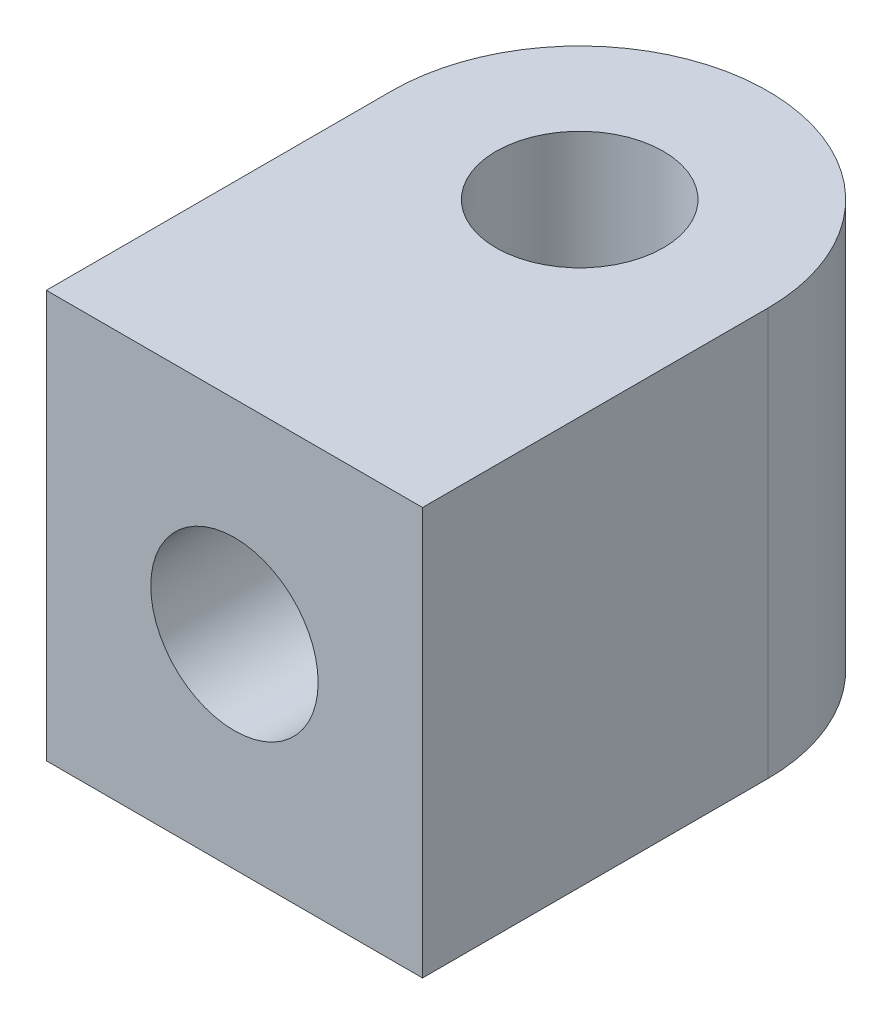
ISO-10303-21;
HEADER;
FILE_DESCRIPTION(('STEP AP214'),'2;1');
FILE_NAME('part.step','',(''),(''),'','','');
FILE_SCHEMA(('AUTOMOTIVE_DESIGN { 1 0 10303 214 1 1 1 1 }'));
ENDSEC;
DATA;
#1=APPLICATION_CONTEXT('core data for automotive mechanical design processes');
#2=APPLICATION_PROTOCOL_DEFINITION('international standard','automotive_design',2000,#1);
#3=PRODUCT_CONTEXT('',#1,'mechanical');
#4=PRODUCT('Part','Part','',(#3));
#5=PRODUCT_RELATED_PRODUCT_CATEGORY('part','',(#4));
#6=PRODUCT_DEFINITION_FORMATION('','',#4);
#7=PRODUCT_DEFINITION_CONTEXT('part definition',#1,'design');
#8=PRODUCT_DEFINITION('design','',#6,#7);
#9=PRODUCT_DEFINITION_SHAPE('','',#8);
#10=(LENGTH_UNIT() NAMED_UNIT(*) SI_UNIT(.MILLI.,.METRE.));
#11=(NAMED_UNIT(*) PLANE_ANGLE_UNIT() SI_UNIT($,.RADIAN.));
#12=(NAMED_UNIT(*) SI_UNIT($,.STERADIAN.) SOLID_ANGLE_UNIT());
#13=UNCERTAINTY_MEASURE_WITH_UNIT(LENGTH_MEASURE(1.E-05),#10,'distance_accuracy_value','');
#14=(GEOMETRIC_REPRESENTATION_CONTEXT(3) GLOBAL_UNCERTAINTY_ASSIGNED_CONTEXT((#13)) GLOBAL_UNIT_ASSIGNED_CONTEXT((#10,
#11,#12)) REPRESENTATION_CONTEXT('',''));
#15=CARTESIAN_POINT('',(0.,0.,0.));
#16=DIRECTION('',(0.,0.,1.));
#17=DIRECTION('',(1.,0.,0.));
#18=AXIS2_PLACEMENT_3D('',#15,#16,#17);
#19=CARTESIAN_POINT('',(0.,6.58622,0.));
#20=DIRECTION('',(0.,-1.,0.));
#21=DIRECTION('',(0.,0.,-1.));
#22=AXIS2_PLACEMENT_3D('',#19,#20,#21);
#23=CYLINDRICAL_SURFACE('',#22,3.04038);
#24=CARTESIAN_POINT('',(0.,0.,0.));
#25=DIRECTION('',(0.,-1.,0.));
#26=DIRECTION('',(0.,0.,-1.));
#27=AXIS2_PLACEMENT_3D('',#24,#25,#26);
#28=CIRCLE('',#27,3.04038);
#29=CARTESIAN_POINT('',(-3.04038,0.,0.));
#30=VERTEX_POINT('',#29);
#31=CARTESIAN_POINT('',(3.04038,0.,0.));
#32=VERTEX_POINT('',#31);
#33=EDGE_CURVE('E101',#30,#32,#28,.T.);
#34=ORIENTED_EDGE('',*,*,#33,.F.);
#35=DIRECTION('',(0.,-1.,0.));
#36=VECTOR('',#35,1.);
#37=CARTESIAN_POINT('',(-3.04038,6.58622,0.));
#38=LINE('',#37,#36);
#39=CARTESIAN_POINT('',(-3.04038,6.58622,0.));
#40=VERTEX_POINT('',#39);
#41=EDGE_CURVE('E53',#40,#30,#38,.T.);
#42=ORIENTED_EDGE('',*,*,#41,.F.);
#43=CARTESIAN_POINT('',(0.,6.58622,0.));
#44=DIRECTION('',(0.,-1.,0.));
#45=DIRECTION('',(0.,0.,-1.));
#46=AXIS2_PLACEMENT_3D('',#43,#44,#45);
#47=CIRCLE('',#46,3.04038);
#48=CARTESIAN_POINT('',(3.04038,6.58622,0.));
#49=VERTEX_POINT('',#48);
#50=EDGE_CURVE('E106',#40,#49,#47,.T.);
#51=ORIENTED_EDGE('',*,*,#50,.T.);
#52=DIRECTION('',(0.,-1.,0.));
#53=VECTOR('',#52,1.);
#54=CARTESIAN_POINT('',(3.04038,6.58622,0.));
#55=LINE('',#54,#53);
#56=EDGE_CURVE('E79',#49,#32,#55,.T.);
#57=ORIENTED_EDGE('',*,*,#56,.T.);
#58=EDGE_LOOP('',(#34,#42,#51,#57));
#59=FACE_BOUND('',#58,.T.);
#60=ADVANCED_FACE('F33',(#59),#23,.T.);
#61=CARTESIAN_POINT('',(-3.04038,6.58622,5.58038));
#62=DIRECTION('',(-1.,0.,0.));
#63=DIRECTION('',(0.,0.,1.));
#64=AXIS2_PLACEMENT_3D('',#61,#62,#63);
#65=PLANE('',#64);
#66=DIRECTION('',(0.,0.,-1.));
#67=VECTOR('',#66,1.);
#68=CARTESIAN_POINT('',(-3.04038,0.,5.58038));
#69=LINE('',#68,#67);
#70=CARTESIAN_POINT('',(-3.04038,0.,5.58038));
#71=VERTEX_POINT('',#70);
#72=EDGE_CURVE('E109',#71,#30,#69,.T.);
#73=ORIENTED_EDGE('',*,*,#72,.F.);
#74=DIRECTION('',(0.,-1.,0.));
#75=VECTOR('',#74,1.);
#76=CARTESIAN_POINT('',(-3.04038,6.58622,5.58038));
#77=LINE('',#76,#75);
#78=CARTESIAN_POINT('',(-3.04038,6.58622,5.58038));
#79=VERTEX_POINT('',#78);
#80=EDGE_CURVE('E127',#79,#71,#77,.T.);
#81=ORIENTED_EDGE('',*,*,#80,.F.);
#82=DIRECTION('',(0.,0.,-1.));
#83=VECTOR('',#82,1.);
#84=CARTESIAN_POINT('',(-3.04038,6.58622,5.58038));
#85=LINE('',#84,#83);
#86=EDGE_CURVE('E114',#79,#40,#85,.T.);
#87=ORIENTED_EDGE('',*,*,#86,.T.);
#88=ORIENTED_EDGE('',*,*,#41,.T.);
#89=EDGE_LOOP('',(#73,#81,#87,#88));
#90=FACE_BOUND('',#89,.T.);
#91=ADVANCED_FACE('F134',(#90),#65,.T.);
#92=CARTESIAN_POINT('',(3.04038,6.58622,5.58038));
#93=DIRECTION('',(0.,0.,1.));
#94=DIRECTION('',(1.,0.,0.));
#95=AXIS2_PLACEMENT_3D('',#92,#93,#94);
#96=PLANE('',#95);
#97=CARTESIAN_POINT('',(0.,3.29311,5.58038));
#98=DIRECTION('',(0.,0.,1.));
#99=DIRECTION('',(1.,0.,0.));
#100=AXIS2_PLACEMENT_3D('',#97,#98,#99);
#101=CIRCLE('',#100,1.35254999999998);
#102=CARTESIAN_POINT('',(1.35254999999998,3.29311,5.58038));
#103=VERTEX_POINT('',#102);
#104=EDGE_CURVE('E99',#103,#103,#101,.T.);
#105=ORIENTED_EDGE('',*,*,#104,.F.);
#106=EDGE_LOOP('',(#105));
#107=FACE_BOUND('',#106,.T.);
#108=DIRECTION('',(-1.,0.,0.));
#109=VECTOR('',#108,1.);
#110=CARTESIAN_POINT('',(3.04038,0.,5.58038));
#111=LINE('',#110,#109);
#112=CARTESIAN_POINT('',(3.04038,0.,5.58038));
#113=VERTEX_POINT('',#112);
#114=EDGE_CURVE('E121',#113,#71,#111,.T.);
#115=ORIENTED_EDGE('',*,*,#114,.F.);
#116=DIRECTION('',(0.,-1.,0.));
#117=VECTOR('',#116,1.);
#118=CARTESIAN_POINT('',(3.04038,6.58622,5.58038));
#119=LINE('',#118,#117);
#120=CARTESIAN_POINT('',(3.04038,6.58622,5.58038));
#121=VERTEX_POINT('',#120);
#122=EDGE_CURVE('E129',#121,#113,#119,.T.);
#123=ORIENTED_EDGE('',*,*,#122,.F.);
#124=DIRECTION('',(-1.,0.,0.));
#125=VECTOR('',#124,1.);
#126=CARTESIAN_POINT('',(3.04038,6.58622,5.58038));
#127=LINE('',#126,#125);
#128=EDGE_CURVE('E111',#121,#79,#127,.T.);
#129=ORIENTED_EDGE('',*,*,#128,.T.);
#130=ORIENTED_EDGE('',*,*,#80,.T.);
#131=EDGE_LOOP('',(#115,#123,#129,#130));
#132=FACE_BOUND('',#131,.T.);
#133=ADVANCED_FACE('F138',(#107,#132),#96,.T.);
#134=CARTESIAN_POINT('',(3.04038,6.58622,0.));
#135=DIRECTION('',(1.,0.,0.));
#136=DIRECTION('',(0.,0.,-1.));
#137=AXIS2_PLACEMENT_3D('',#134,#135,#136);
#138=PLANE('',#137);
#139=DIRECTION('',(0.,0.,1.));
#140=VECTOR('',#139,1.);
#141=CARTESIAN_POINT('',(3.04038,0.,0.));
#142=LINE('',#141,#140);
#143=EDGE_CURVE('E118',#32,#113,#142,.T.);
#144=ORIENTED_EDGE('',*,*,#143,.F.);
#145=ORIENTED_EDGE('',*,*,#56,.F.);
#146=DIRECTION('',(0.,0.,1.));
#147=VECTOR('',#146,1.);
#148=CARTESIAN_POINT('',(3.04038,6.58622,0.));
#149=LINE('',#148,#147);
#150=EDGE_CURVE('E108',#49,#121,#149,.T.);
#151=ORIENTED_EDGE('',*,*,#150,.T.);
#152=ORIENTED_EDGE('',*,*,#122,.T.);
#153=EDGE_LOOP('',(#144,#145,#151,#152));
#154=FACE_BOUND('',#153,.T.);
#155=ADVANCED_FACE('F131',(#154),#138,.T.);
#156=CARTESIAN_POINT('',(0.,6.58622,0.));
#157=DIRECTION('',(0.,-1.,0.));
#158=DIRECTION('',(0.,0.,-1.));
#159=AXIS2_PLACEMENT_3D('',#156,#157,#158);
#160=PLANE('',#159);
#161=CARTESIAN_POINT('',(0.,6.58622,0.));
#162=DIRECTION('',(0.,-1.,0.));
#163=DIRECTION('',(0.,0.,-1.));
#164=AXIS2_PLACEMENT_3D('',#161,#162,#163);
#165=CIRCLE('',#164,1.35254999999998);
#166=CARTESIAN_POINT('',(0.,6.58622,-1.35254999999998));
#167=VERTEX_POINT('',#166);
#168=EDGE_CURVE('E94',#167,#167,#165,.T.);
#169=ORIENTED_EDGE('',*,*,#168,.T.);
#170=EDGE_LOOP('',(#169));
#171=FACE_BOUND('',#170,.T.);
#172=ORIENTED_EDGE('',*,*,#50,.F.);
#173=ORIENTED_EDGE('',*,*,#86,.F.);
#174=ORIENTED_EDGE('',*,*,#128,.F.);
#175=ORIENTED_EDGE('',*,*,#150,.F.);
#176=EDGE_LOOP('',(#172,#173,#174,#175));
#177=FACE_BOUND('',#176,.T.);
#178=ADVANCED_FACE('F140',(#171,#177),#160,.F.);
#179=CARTESIAN_POINT('',(0.,0.,0.));
#180=DIRECTION('',(0.,-1.,0.));
#181=DIRECTION('',(0.,0.,-1.));
#182=AXIS2_PLACEMENT_3D('',#179,#180,#181);
#183=PLANE('',#182);
#184=CARTESIAN_POINT('',(0.,0.,0.));
#185=DIRECTION('',(0.,-1.,0.));
#186=DIRECTION('',(0.,0.,-1.));
#187=AXIS2_PLACEMENT_3D('',#184,#185,#186);
#188=CIRCLE('',#187,1.35254999999998);
#189=CARTESIAN_POINT('',(0.,0.,-1.35254999999998));
#190=VERTEX_POINT('',#189);
#191=EDGE_CURVE('E97',#190,#190,#188,.T.);
#192=ORIENTED_EDGE('',*,*,#191,.F.);
#193=EDGE_LOOP('',(#192));
#194=FACE_BOUND('',#193,.T.);
#195=ORIENTED_EDGE('',*,*,#33,.T.);
#196=ORIENTED_EDGE('',*,*,#143,.T.);
#197=ORIENTED_EDGE('',*,*,#114,.T.);
#198=ORIENTED_EDGE('',*,*,#72,.T.);
#199=EDGE_LOOP('',(#195,#196,#197,#198));
#200=FACE_BOUND('',#199,.T.);
#201=ADVANCED_FACE('F89',(#194,#200),#183,.T.);
#202=CARTESIAN_POINT('',(0.,0.,0.));
#203=DIRECTION('',(0.,-1.,0.));
#204=DIRECTION('',(0.,0.,-1.));
#205=AXIS2_PLACEMENT_3D('',#202,#203,#204);
#206=CYLINDRICAL_SURFACE('',#205,1.35254999999998);
#207=CARTESIAN_POINT('',(0.,3.29311,0.));
#208=DIRECTION('',(0.,-0.707106781186547,-0.707106781186547));
#209=DIRECTION('',(0.,-0.707106781186547,0.707106781186547));
#210=AXIS2_PLACEMENT_3D('',#207,#208,#209);
#211=ELLIPSE('',#210,1.91279455378771,1.35254999999998);
#212=CARTESIAN_POINT('',(-1.35254999999999,3.29311,0.));
#213=VERTEX_POINT('',#212);
#214=CARTESIAN_POINT('',(1.35254999999998,3.29311,0.));
#215=VERTEX_POINT('',#214);
#216=EDGE_CURVE('E40',#213,#215,#211,.F.);
#217=ORIENTED_EDGE('',*,*,#216,.T.);
#218=CARTESIAN_POINT('',(0.,3.29311,0.));
#219=DIRECTION('',(0.,-0.707106781186547,0.707106781186547));
#220=DIRECTION('',(0.,-0.707106781186547,-0.707106781186547));
#221=AXIS2_PLACEMENT_3D('',#218,#219,#220);
#222=ELLIPSE('',#221,1.91279455378771,1.35254999999998);
#223=EDGE_CURVE('E11',#215,#213,#222,.T.);
#224=ORIENTED_EDGE('',*,*,#223,.T.);
#225=EDGE_LOOP('',(#217,#224));
#226=FACE_BOUND('',#225,.T.);
#227=ORIENTED_EDGE('',*,*,#168,.F.);
#228=EDGE_LOOP('',(#227));
#229=FACE_BOUND('',#228,.T.);
#230=ORIENTED_EDGE('',*,*,#191,.T.);
#231=EDGE_LOOP('',(#230));
#232=FACE_BOUND('',#231,.T.);
#233=ADVANCED_FACE('F86',(#226,#229,#232),#206,.F.);
#234=CARTESIAN_POINT('',(0.,3.29311,5.58038));
#235=DIRECTION('',(0.,0.,1.));
#236=DIRECTION('',(1.,0.,0.));
#237=AXIS2_PLACEMENT_3D('',#234,#235,#236);
#238=CYLINDRICAL_SURFACE('',#237,1.35254999999999);
#239=ORIENTED_EDGE('',*,*,#216,.F.);
#240=ORIENTED_EDGE('',*,*,#223,.F.);
#241=EDGE_LOOP('',(#239,#240));
#242=FACE_BOUND('',#241,.T.);
#243=ORIENTED_EDGE('',*,*,#104,.T.);
#244=EDGE_LOOP('',(#243));
#245=FACE_BOUND('',#244,.T.);
#246=ADVANCED_FACE('F83',(#242,#245),#238,.F.);
#247=CLOSED_SHELL('',(#60,#91,#133,#155,#178,#201,#233,#246));
#248=MANIFOLD_SOLID_BREP('B2',#247);
#249=ADVANCED_BREP_SHAPE_REPRESENTATION('',(#18,#248),#14);
#250=SHAPE_DEFINITION_REPRESENTATION(#9,#249);
ENDSEC;
END-ISO-10303-21;
